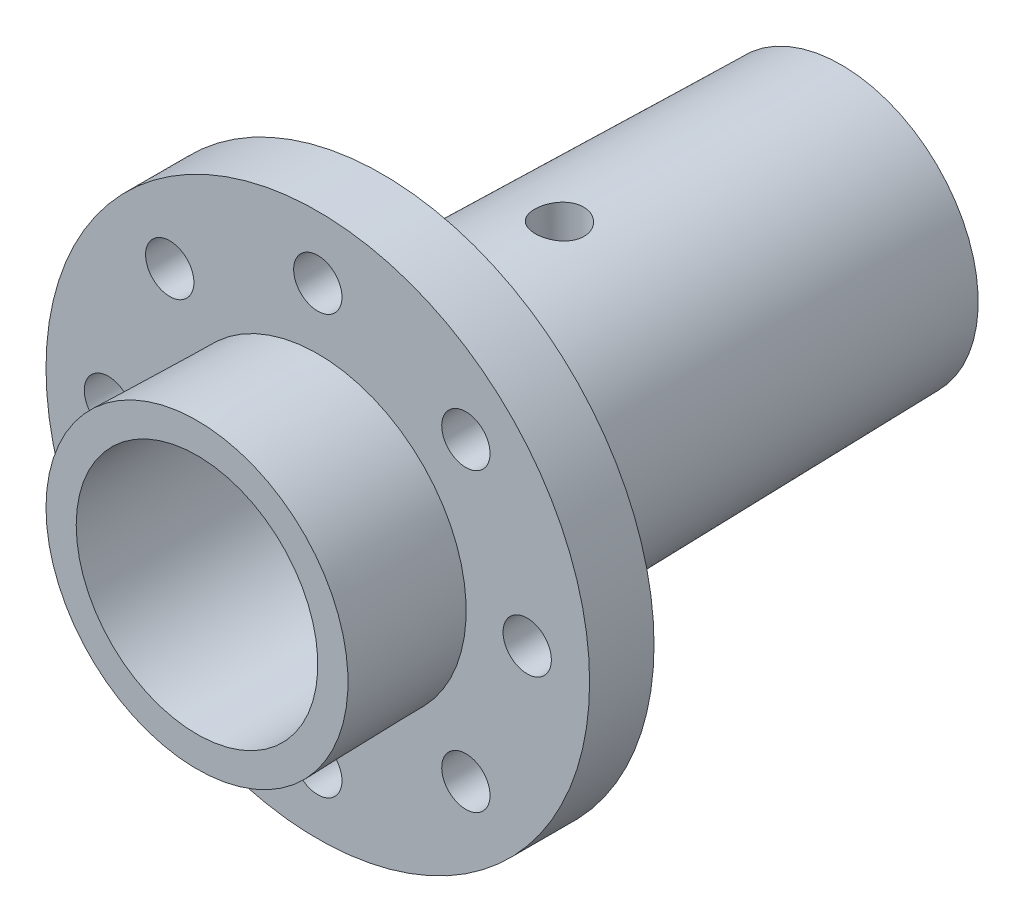
ISO-10303-21;
HEADER;
FILE_DESCRIPTION(('STEP AP214'),'2;1');
FILE_NAME('part.step','',(''),(''),'','','');
FILE_SCHEMA(('AUTOMOTIVE_DESIGN { 1 0 10303 214 1 1 1 1 }'));
ENDSEC;
DATA;
#1=APPLICATION_CONTEXT('core data for automotive mechanical design processes');
#2=APPLICATION_PROTOCOL_DEFINITION('international standard','automotive_design',2000,#1);
#3=PRODUCT_CONTEXT('',#1,'mechanical');
#4=PRODUCT('Part','Part','',(#3));
#5=PRODUCT_RELATED_PRODUCT_CATEGORY('part','',(#4));
#6=PRODUCT_DEFINITION_FORMATION('','',#4);
#7=PRODUCT_DEFINITION_CONTEXT('part definition',#1,'design');
#8=PRODUCT_DEFINITION('design','',#6,#7);
#9=PRODUCT_DEFINITION_SHAPE('','',#8);
#10=(LENGTH_UNIT() NAMED_UNIT(*) SI_UNIT(.MILLI.,.METRE.));
#11=(NAMED_UNIT(*) PLANE_ANGLE_UNIT() SI_UNIT($,.RADIAN.));
#12=(NAMED_UNIT(*) SI_UNIT($,.STERADIAN.) SOLID_ANGLE_UNIT());
#13=UNCERTAINTY_MEASURE_WITH_UNIT(LENGTH_MEASURE(1.E-05),#10,'distance_accuracy_value','');
#14=(GEOMETRIC_REPRESENTATION_CONTEXT(3) GLOBAL_UNCERTAINTY_ASSIGNED_CONTEXT((#13)) GLOBAL_UNIT_ASSIGNED_CONTEXT((#10,
#11,#12)) REPRESENTATION_CONTEXT('',''));
#15=CARTESIAN_POINT('',(0.,0.,0.));
#16=DIRECTION('',(0.,0.,1.));
#17=DIRECTION('',(1.,0.,0.));
#18=AXIS2_PLACEMENT_3D('',#15,#16,#17);
#19=CARTESIAN_POINT('',(0.,0.,-40.));
#20=DIRECTION('',(0.,0.,1.));
#21=DIRECTION('',(1.,0.,0.));
#22=AXIS2_PLACEMENT_3D('',#19,#20,#21);
#23=CONICAL_SURFACE('',#22,17.,0.0218715118250005);
#24=CARTESIAN_POINT('',(0.,0.,-40.));
#25=DIRECTION('',(0.,0.,-1.));
#26=DIRECTION('',(-1.,0.,0.));
#27=AXIS2_PLACEMENT_3D('',#24,#25,#26);
#28=CIRCLE('',#27,17.);
#29=CARTESIAN_POINT('',(-17.,0.,-40.));
#30=VERTEX_POINT('',#29);
#31=EDGE_CURVE('E10',#30,#30,#28,.T.);
#32=ORIENTED_EDGE('',*,*,#31,.F.);
#33=EDGE_LOOP('',(#32));
#34=FACE_BOUND('',#33,.T.);
#35=CARTESIAN_POINT('',(0.,0.,17.));
#36=DIRECTION('',(0.,0.,-1.));
#37=DIRECTION('',(-1.,0.,0.));
#38=AXIS2_PLACEMENT_3D('',#35,#36,#37);
#39=CIRCLE('',#38,18.246875);
#40=CARTESIAN_POINT('',(-18.246875,0.,17.));
#41=VERTEX_POINT('',#40);
#42=EDGE_CURVE('E58',#41,#41,#39,.T.);
#43=ORIENTED_EDGE('',*,*,#42,.T.);
#44=EDGE_LOOP('',(#43));
#45=FACE_BOUND('',#44,.T.);
#46=CARTESIAN_POINT('',(-2.13641248189681,17.5902905697979,-7.10612006001501));
#47=CARTESIAN_POINT('',(-2.01820031551979,17.6020045137629,-7.22602386010126));
#48=CARTESIAN_POINT('',(-1.88982058744187,17.6139661525499,-7.33600858004159));
#49=CARTESIAN_POINT('',(-1.6162869445784,17.6368416474846,-7.5329964557158));
#50=CARTESIAN_POINT('',(-1.47111788649196,17.6477545412079,-7.61997862802704));
#51=CARTESIAN_POINT('',(-1.16809070797555,17.6671433384036,-7.76839570893532));
#52=CARTESIAN_POINT('',(-1.01023276488835,17.6756192759278,-7.82983097450774));
#53=CARTESIAN_POINT('',(-0.686333859133014,17.689065282501,-7.92531122112214));
#54=CARTESIAN_POINT('',(-0.520294950041707,17.694036226621,-7.95936303912614));
#55=CARTESIAN_POINT('',(-0.185923391358476,17.6998311995654,-7.99893008702051));
#56=CARTESIAN_POINT('',(-0.0176139654522799,17.7006831514838,-8.00463747408034));
#57=CARTESIAN_POINT('',(0.317563716428026,17.6982101811075,-7.98786034793744));
#58=CARTESIAN_POINT('',(0.484431965140521,17.6948852377792,-7.96537569276771));
#59=CARTESIAN_POINT('',(0.811132773963448,17.684497707079,-7.89308081715635));
#60=CARTESIAN_POINT('',(0.970996321274204,17.6774538773261,-7.84340768638268));
#61=CARTESIAN_POINT('',(1.28013200786045,17.6605050653099,-7.71828461417816));
#62=CARTESIAN_POINT('',(1.42940363205517,17.6505999440219,-7.64283342020701));
#63=CARTESIAN_POINT('',(1.71432771184333,17.62906821204,-7.46764158209522));
#64=CARTESIAN_POINT('',(1.84987167205498,17.6174294505768,-7.36772600226923));
#65=CARTESIAN_POINT('',(2.10236916621167,17.593956123338,-7.14667233600477));
#66=CARTESIAN_POINT('',(2.21932171294242,17.5821215472014,-7.02553312329722));
#67=CARTESIAN_POINT('',(2.43219260158585,17.5597143499883,-6.764376648773));
#68=CARTESIAN_POINT('',(2.52794879117733,17.5491517214306,-6.62422625176943));
#69=CARTESIAN_POINT('',(2.69455614400661,17.5308646899681,-6.32965969767366));
#70=CARTESIAN_POINT('',(2.76540845692414,17.5231401560428,-6.17524419954114));
#71=CARTESIAN_POINT('',(2.87976110238903,17.5117549410538,-5.85750312953902));
#72=CARTESIAN_POINT('',(2.92342370253595,17.5080700491034,-5.69423686408784));
#73=CARTESIAN_POINT('',(2.98275636101598,17.5054181493743,-5.36266287458589));
#74=CARTESIAN_POINT('',(2.99842865392274,17.5064507649553,-5.19435555407278));
#75=CARTESIAN_POINT('',(3.0013303163255,17.513386061514,-4.85945558289645));
#76=CARTESIAN_POINT('',(2.98887006863653,17.5192351500835,-4.69286439416861));
#77=CARTESIAN_POINT('',(2.93658220982817,17.5353631334179,-4.36425952926706));
#78=CARTESIAN_POINT('',(2.89675409889852,17.5456421090831,-4.20224593674876));
#79=CARTESIAN_POINT('',(2.79082593580483,17.5697867418954,-3.88688160768614));
#80=CARTESIAN_POINT('',(2.72465934034243,17.5836614523234,-3.73355394534118));
#81=CARTESIAN_POINT('',(2.56797426163471,17.6137114001351,-3.44013581756344));
#82=CARTESIAN_POINT('',(2.47745352965398,17.6298868498922,-3.30004657611303));
#83=CARTESIAN_POINT('',(2.27310053393179,17.6632514186991,-3.0349511600539));
#84=CARTESIAN_POINT('',(2.15895566023728,17.6804516659265,-2.91018726445525));
#85=CARTESIAN_POINT('',(1.91128443507503,17.7139666168732,-2.68150857559569));
#86=CARTESIAN_POINT('',(1.77775729909239,17.7302812847111,-2.57759462666133));
#87=CARTESIAN_POINT('',(1.49423235508253,17.7604774636935,-2.3930829161153));
#88=CARTESIAN_POINT('',(1.34415519793755,17.7743463438858,-2.31260487080156));
#89=CARTESIAN_POINT('',(1.03229395559201,17.7981278245912,-2.17808578755983));
#90=CARTESIAN_POINT('',(0.870510913511206,17.808040777108,-2.12404239734322));
#91=CARTESIAN_POINT('',(0.54199976270117,17.8227833507028,-2.04459256647889));
#92=CARTESIAN_POINT('',(0.375359787573045,17.8276755235393,-2.01883345380201));
#93=CARTESIAN_POINT('',(0.040054840746956,17.8320899370389,-1.99556459756818));
#94=CARTESIAN_POINT('',(-0.128609956861912,17.8316126360991,-1.99805244254124));
#95=CARTESIAN_POINT('',(-0.460906486451055,17.8253794763081,-2.03097822125121));
#96=CARTESIAN_POINT('',(-0.624574954830384,17.819690877201,-2.06106001944891));
#97=CARTESIAN_POINT('',(-0.944491929754591,17.8037028908872,-2.14773724606901));
#98=CARTESIAN_POINT('',(-1.10074022920044,17.7934033750719,-2.2043334140366));
#99=CARTESIAN_POINT('',(-1.40229744693407,17.7691520222011,-2.3427038035544));
#100=CARTESIAN_POINT('',(-1.54754750742956,17.7551821087456,-2.42460300169717));
#101=CARTESIAN_POINT('',(-1.82235902100139,17.7249831852813,-2.61115184008497));
#102=CARTESIAN_POINT('',(-1.95191888835747,17.7087539472909,-2.71580377683971));
#103=CARTESIAN_POINT('',(-2.1938271868833,17.6753375873317,-2.94682418153255));
#104=CARTESIAN_POINT('',(-2.30587239330561,17.6581394044364,-3.07350872953194));
#105=CARTESIAN_POINT('',(-2.50718224619423,17.6247089006132,-3.34396352636239));
#106=CARTESIAN_POINT('',(-2.5964460434162,17.6084766157093,-3.48773441184443));
#107=CARTESIAN_POINT('',(-2.75002189445334,17.5784754509257,-3.78916419452177));
#108=CARTESIAN_POINT('',(-2.81421258131108,17.5647187228985,-3.94688621964626));
#109=CARTESIAN_POINT('',(-2.91506927353847,17.5410727609961,-4.27116837453528));
#110=CARTESIAN_POINT('',(-2.95173845485482,17.5311830809316,-4.43772748213588));
#111=CARTESIAN_POINT('',(-2.99609586288227,17.5162208851743,-4.7727972472299));
#112=CARTESIAN_POINT('',(-3.0041327450069,17.5110909831662,-4.9412591882312));
#113=CARTESIAN_POINT('',(-2.99188683457768,17.5057309368761,-5.27725671550963));
#114=CARTESIAN_POINT('',(-2.97160077837391,17.5055013573075,-5.44479219279697));
#115=CARTESIAN_POINT('',(-2.90364022840856,17.5096363762436,-5.77239539149831));
#116=CARTESIAN_POINT('',(-2.85623924200757,17.5139554531869,-5.93252067930991));
#117=CARTESIAN_POINT('',(-2.73566127702408,17.5263300753921,-6.2424847546913));
#118=CARTESIAN_POINT('',(-2.66250570972393,17.5343825186463,-6.39233196375953));
#119=CARTESIAN_POINT('',(-2.51583298174385,17.5504840360313,-6.63864896777253));
#120=CARTESIAN_POINT('',(-2.44787449704673,17.557933044654,-6.738517362246));
#121=CARTESIAN_POINT('',(-2.30048592149043,17.5736425520947,-6.92932578266738));
#122=CARTESIAN_POINT('',(-2.22105563191707,17.5819030649687,-7.02026565390989));
#123=CARTESIAN_POINT('',(-2.13641248189681,17.5902905697979,-7.10612006001501));
#124=B_SPLINE_CURVE_WITH_KNOTS('',3,(#46,#47,#48,#49,#50,#51,#52,#53,#54,#55,#56,#57,#58,#59,
#60,#61,#62,#63,#64,#65,#66,#67,#68,#69,#70,#71,#72,#73,#74,#75,#76,#77,#78,#79,#80,#81,#82,#83,
#84,#85,#86,#87,#88,#89,#90,#91,#92,#93,#94,#95,#96,#97,#98,#99,#100,#101,#102,#103,#104,#105,
#106,#107,#108,#109,#110,#111,#112,#113,#114,#115,#116,#117,#118,#119,#120,#121,#122,#123),
.UNSPECIFIED.,.T.,.F.,(4,2,2,2,2,2,2,2,2,2,2,2,2,2,2,2,2,2,2,2,2,2,2,2,2,2,2,2,2,2,2,2,2,2,2,2,
2,2,4),(0.,0.505919457244919,1.01229884552668,1.51867115776383,2.02491700221137,
2.52772609259036,3.03053771498118,3.53083710934032,4.03116081639843,4.53517235629679,
5.03921065055194,5.54698092895207,6.05472776321499,6.55941458158498,7.06406110706811,
7.5631671709221,8.06228235002772,8.56266661273795,9.06309709421736,9.57062979930826,
10.0781830529836,10.5882852733757,11.0983420940442,11.6019642247643,12.1055433611012,
12.6027132338826,13.0998969746716,13.5995767598584,14.099307002824,14.6069081304926,
15.1145281777299,15.6245757914701,16.1345645373111,16.6383215130648,17.142136541486,
17.6409570282245,18.1393637919567,18.5016097094647,18.8638619025357),.UNSPECIFIED.);
#125=CARTESIAN_POINT('',(-2.13641248189681,17.5902905697979,-7.10612006001501));
#126=VERTEX_POINT('',#125);
#127=EDGE_CURVE('E111',#126,#126,#124,.T.);
#128=ORIENTED_EDGE('',*,*,#127,.T.);
#129=EDGE_LOOP('',(#128));
#130=FACE_BOUND('',#129,.T.);
#131=ADVANCED_FACE('F35',(#34,#45,#130),#23,.T.);
#132=CARTESIAN_POINT('',(0.,0.,-65.0810987124463));
#133=DIRECTION('',(0.,0.,-1.));
#134=DIRECTION('',(-1.,0.,0.));
#135=AXIS2_PLACEMENT_3D('',#132,#133,#134);
#136=CYLINDRICAL_SURFACE('',#135,12.);
#137=CARTESIAN_POINT('',(0.,0.,-40.));
#138=DIRECTION('',(0.,0.,-1.));
#139=DIRECTION('',(-1.,0.,0.));
#140=AXIS2_PLACEMENT_3D('',#137,#138,#139);
#141=CIRCLE('',#140,12.);
#142=CARTESIAN_POINT('',(-12.,0.,-40.));
#143=VERTEX_POINT('',#142);
#144=EDGE_CURVE('E48',#143,#143,#141,.T.);
#145=ORIENTED_EDGE('',*,*,#144,.T.);
#146=EDGE_LOOP('',(#145));
#147=FACE_BOUND('',#146,.T.);
#148=CARTESIAN_POINT('',(0.,0.,10.));
#149=DIRECTION('',(0.,0.,-1.));
#150=DIRECTION('',(-1.,0.,0.));
#151=AXIS2_PLACEMENT_3D('',#148,#149,#150);
#152=CIRCLE('',#151,12.);
#153=CARTESIAN_POINT('',(-12.,0.,10.));
#154=VERTEX_POINT('',#153);
#155=EDGE_CURVE('E56',#154,#154,#152,.T.);
#156=ORIENTED_EDGE('',*,*,#155,.F.);
#157=EDGE_LOOP('',(#156));
#158=FACE_BOUND('',#157,.T.);
#159=CARTESIAN_POINT('',(0.,12.,-8.));
#160=CARTESIAN_POINT('',(-0.165752177339462,11.9999971973602,-7.99999534852368));
#161=CARTESIAN_POINT('',(-0.331556315661526,11.9965315626365,-7.98621689845242));
#162=CARTESIAN_POINT('',(-0.658412647541066,11.9830422765979,-7.93154969738599));
#163=CARTESIAN_POINT('',(-0.819462093741479,11.9730149083995,-7.8906455809243));
#164=CARTESIAN_POINT('',(-1.13204174436515,11.9475125266406,-7.78312149307583));
#165=CARTESIAN_POINT('',(-1.28358312686,11.9320440568412,-7.71653240256946));
#166=CARTESIAN_POINT('',(-1.57334426380885,11.8973068761524,-7.55963721991031));
#167=CARTESIAN_POINT('',(-1.71156356869753,11.8780380370831,-7.46933032776206));
#168=CARTESIAN_POINT('',(-1.97360385460183,11.8373482718339,-7.26559842069164));
#169=CARTESIAN_POINT('',(-2.09711138012211,11.8158941429625,-7.15177685008188));
#170=CARTESIAN_POINT('',(-2.32349785440664,11.7734724023587,-6.90509559018193));
#171=CARTESIAN_POINT('',(-2.42637447389838,11.7525048457973,-6.77223375410613));
#172=CARTESIAN_POINT('',(-2.61005308559795,11.7130955139634,-6.48880954652602));
#173=CARTESIAN_POINT('',(-2.69050443185028,11.6946958892962,-6.33801353838254));
#174=CARTESIAN_POINT('',(-2.82479381710149,11.6629898963603,-6.02450317667993));
#175=CARTESIAN_POINT('',(-2.87863611088028,11.6496827138884,-5.86179073333597));
#176=CARTESIAN_POINT('',(-2.95710967360953,11.6300095339265,-5.53251300359668));
#177=CARTESIAN_POINT('',(-2.98230453666411,11.6235098199402,-5.36609020792401));
#178=CARTESIAN_POINT('',(-3.00452355013282,11.6177872491918,-5.03126286200131));
#179=CARTESIAN_POINT('',(-3.00155228363622,11.6185632085586,-4.86285863861572));
#180=CARTESIAN_POINT('',(-2.96797304927941,11.6271841103363,-4.53316838450929));
#181=CARTESIAN_POINT('',(-2.93803668038127,11.6348572601459,-4.37180875706934));
#182=CARTESIAN_POINT('',(-2.85244837380599,11.6561341934214,-4.05647789817788));
#183=CARTESIAN_POINT('',(-2.79679460413879,11.6697383993848,-3.90250719394216));
#184=CARTESIAN_POINT('',(-2.66077895587437,11.7015022781132,-3.60452396749574));
#185=CARTESIAN_POINT('',(-2.58017333446584,11.7197065493963,-3.46062765642086));
#186=CARTESIAN_POINT('',(-2.39671255202989,11.7585942169198,-3.18816258048636));
#187=CARTESIAN_POINT('',(-2.29385349761767,11.7792780466926,-3.0595965038655));
#188=CARTESIAN_POINT('',(-2.06532684936244,11.8215176107978,-2.81759276861119));
#189=CARTESIAN_POINT('',(-1.93909251633172,11.84308138956,-2.7046910198773));
#190=CARTESIAN_POINT('',(-1.6692238350074,11.8841193115751,-2.50155751507219));
#191=CARTESIAN_POINT('',(-1.52558895541589,11.9035933909881,-2.41132645147287));
#192=CARTESIAN_POINT('',(-1.22423177736278,11.9383546418838,-2.25589882755123));
#193=CARTESIAN_POINT('',(-1.06646278641725,11.9536272025545,-2.19078931949114));
#194=CARTESIAN_POINT('',(-0.741752016285765,11.9781583398283,-2.08816538858085));
#195=CARTESIAN_POINT('',(-0.574811998300969,11.9874180667856,-2.05064568716372));
#196=CARTESIAN_POINT('',(-0.241079940780054,11.9987099854275,-2.00508486888232));
#197=CARTESIAN_POINT('',(-0.0743934399764205,12.0009210701655,-1.99631394784939));
#198=CARTESIAN_POINT('',(0.258065749603017,11.998376096289,-2.00649800411097));
#199=CARTESIAN_POINT('',(0.423838519289192,11.9936206648371,-2.02545048559827));
#200=CARTESIAN_POINT('',(0.747228537552981,11.977791622547,-2.08994181678275));
#201=CARTESIAN_POINT('',(0.9049302379375,11.9668126837158,-2.13508252695394));
#202=CARTESIAN_POINT('',(1.21051458490503,11.9397741326831,-2.25021416805692));
#203=CARTESIAN_POINT('',(1.3583962380653,11.9237140073996,-2.32020760862644));
#204=CARTESIAN_POINT('',(1.64304626885966,11.8878661585244,-2.48447225774935));
#205=CARTESIAN_POINT('',(1.77957088367153,11.868017347332,-2.57915222479313));
#206=CARTESIAN_POINT('',(2.03505322728662,11.826890183755,-2.78957981759433));
#207=CARTESIAN_POINT('',(2.1540079179465,11.8056115850589,-2.90533107923529));
#208=CARTESIAN_POINT('',(2.37398113614497,11.76337913919,-3.15800392168741));
#209=CARTESIAN_POINT('',(2.47448773524221,11.7424460836496,-3.29537540599912));
#210=CARTESIAN_POINT('',(2.65102151802725,11.7038575676408,-3.58546526893716));
#211=CARTESIAN_POINT('',(2.72704978832281,11.6862019616993,-3.73818296594089));
#212=CARTESIAN_POINT('',(2.85190284121468,11.656361894336,-4.05381144481247));
#213=CARTESIAN_POINT('',(2.90088879328717,11.6441451045097,-4.21665525662459));
#214=CARTESIAN_POINT('',(2.97069131988587,11.626534880479,-4.54861927571059));
#215=CARTESIAN_POINT('',(2.99151405495183,11.6211399540485,-4.7177381020429));
#216=CARTESIAN_POINT('',(3.004077180673,11.6178980244193,-5.05224204772322));
#217=CARTESIAN_POINT('',(2.99663579556158,11.6198386546564,-5.21759487025289));
#218=CARTESIAN_POINT('',(2.95475455662439,11.6305581800657,-5.54460777733253));
#219=CARTESIAN_POINT('',(2.92031524537318,11.6393369378128,-5.70626793602638));
#220=CARTESIAN_POINT('',(2.82586263888594,11.6626252136787,-6.02041691813173));
#221=CARTESIAN_POINT('',(2.76600280936085,11.6771003047327,-6.17295461048066));
#222=CARTESIAN_POINT('',(2.62252982721004,11.7101551144901,-6.46593076542713));
#223=CARTESIAN_POINT('',(2.53891338006835,11.7287354024137,-6.60636754637376));
#224=CARTESIAN_POINT('',(2.3477354972743,11.768512685272,-6.87510925800411));
#225=CARTESIAN_POINT('',(2.23960632582451,11.7897652966356,-7.00300214684793));
#226=CARTESIAN_POINT('',(2.00357874237946,11.8321605449252,-7.2390940895908));
#227=CARTESIAN_POINT('',(1.87567564252229,11.8533031545411,-7.34728846022593));
#228=CARTESIAN_POINT('',(1.60093517340518,11.8935531129534,-7.54282261712922));
#229=CARTESIAN_POINT('',(1.45379684463277,11.9126166673174,-7.62974922734316));
#230=CARTESIAN_POINT('',(1.14653211902095,11.9460984995023,-7.77749492588106));
#231=CARTESIAN_POINT('',(0.986415126873477,11.9605201039956,-7.83833272129707));
#232=CARTESIAN_POINT('',(0.688820506486942,11.9809611913108,-7.9231436606593));
#233=CARTESIAN_POINT('',(0.552760341816136,11.9880517010538,-7.95190248610687));
#234=CARTESIAN_POINT('',(0.277812143072567,11.997572104639,-7.99033188724388));
#235=CARTESIAN_POINT('',(0.138924322485233,12.0000023490179,-8.0000038986106));
#236=CARTESIAN_POINT('',(0.,12.,-8.));
#237=B_SPLINE_CURVE_WITH_KNOTS('',3,(#159,#160,#161,#162,#163,#164,#165,#166,#167,#168,#169,
#170,#171,#172,#173,#174,#175,#176,#177,#178,#179,#180,#181,#182,#183,#184,#185,#186,#187,#188,
#189,#190,#191,#192,#193,#194,#195,#196,#197,#198,#199,#200,#201,#202,#203,#204,#205,#206,#207,
#208,#209,#210,#211,#212,#213,#214,#215,#216,#217,#218,#219,#220,#221,#222,#223,#224,#225,#226,
#227,#228,#229,#230,#231,#232,#233,#234,#235,#236),.UNSPECIFIED.,.T.,.F.,(4,2,2,2,2,2,2,2,2,2,2,
2,2,2,2,2,2,2,2,2,2,2,2,2,2,2,2,2,2,2,2,2,2,2,2,2,2,2,4),(0.,0.496747424943779,
0.993776475527799,1.49020980457221,1.98665988033866,2.49228870874278,2.99797459160124,
3.51117295091614,4.02428922338737,4.52712590202139,5.02988076232035,5.52044994020677,
6.01105406938718,6.506610557544,7.00225381678967,7.5120300194468,8.02182179123136,
8.53336458024869,9.04480947383927,9.54316617905194,10.0414780223213,10.5324054903472,
11.0233825465122,11.5230717513735,12.0228472602268,12.5348901841559,13.0469103750566,
13.5558450923716,14.0646684651657,14.5588756080898,15.0530728192382,15.5443280113065,
16.0356513628556,16.5397915283158,17.0440513955259,17.5574437101093,18.0704672765446,
18.4868448589605,18.9031911209784),.UNSPECIFIED.);
#238=CARTESIAN_POINT('',(0.,12.,-8.));
#239=VERTEX_POINT('',#238);
#240=EDGE_CURVE('E39',#239,#239,#237,.T.);
#241=ORIENTED_EDGE('',*,*,#240,.T.);
#242=EDGE_LOOP('',(#241));
#243=FACE_BOUND('',#242,.T.);
#244=ADVANCED_FACE('F98',(#147,#158,#243),#136,.F.);
#245=CARTESIAN_POINT('',(-17.,0.,-40.));
#246=DIRECTION('',(0.,0.,-1.));
#247=DIRECTION('',(-1.,0.,0.));
#248=AXIS2_PLACEMENT_3D('',#245,#246,#247);
#249=PLANE('',#248);
#250=ORIENTED_EDGE('',*,*,#31,.T.);
#251=EDGE_LOOP('',(#250));
#252=FACE_BOUND('',#251,.T.);
#253=ORIENTED_EDGE('',*,*,#144,.F.);
#254=EDGE_LOOP('',(#253));
#255=FACE_BOUND('',#254,.T.);
#256=ADVANCED_FACE('F90',(#252,#255),#249,.T.);
#257=CARTESIAN_POINT('',(-12.,0.,40.));
#258=DIRECTION('',(0.,0.,1.));
#259=DIRECTION('',(1.,0.,0.));
#260=AXIS2_PLACEMENT_3D('',#257,#258,#259);
#261=PLANE('',#260);
#262=CARTESIAN_POINT('',(0.,0.,40.));
#263=DIRECTION('',(0.,0.,-1.));
#264=DIRECTION('',(-1.,0.,0.));
#265=AXIS2_PLACEMENT_3D('',#262,#263,#264);
#266=CIRCLE('',#265,15.);
#267=CARTESIAN_POINT('',(-15.,0.,40.));
#268=VERTEX_POINT('',#267);
#269=EDGE_CURVE('E59',#268,#268,#266,.T.);
#270=ORIENTED_EDGE('',*,*,#269,.T.);
#271=EDGE_LOOP('',(#270));
#272=FACE_BOUND('',#271,.T.);
#273=CARTESIAN_POINT('',(0.,0.,40.));
#274=DIRECTION('',(0.,0.,-1.));
#275=DIRECTION('',(-1.,0.,0.));
#276=AXIS2_PLACEMENT_3D('',#273,#274,#275);
#277=CIRCLE('',#276,18.75);
#278=CARTESIAN_POINT('',(-18.75,0.,40.));
#279=VERTEX_POINT('',#278);
#280=EDGE_CURVE('E53',#279,#279,#277,.T.);
#281=ORIENTED_EDGE('',*,*,#280,.F.);
#282=EDGE_LOOP('',(#281));
#283=FACE_BOUND('',#282,.T.);
#284=ADVANCED_FACE('F88',(#272,#283),#261,.T.);
#285=CARTESIAN_POINT('',(0.,0.,25.));
#286=DIRECTION('',(0.,0.,1.));
#287=DIRECTION('',(1.,0.,0.));
#288=AXIS2_PLACEMENT_3D('',#285,#286,#287);
#289=CONICAL_SURFACE('',#288,18.421875,0.0218715118250006);
#290=ORIENTED_EDGE('',*,*,#280,.T.);
#291=EDGE_LOOP('',(#290));
#292=FACE_BOUND('',#291,.T.);
#293=CARTESIAN_POINT('',(0.,0.,25.));
#294=DIRECTION('',(0.,0.,-1.));
#295=DIRECTION('',(-1.,0.,0.));
#296=AXIS2_PLACEMENT_3D('',#293,#294,#295);
#297=CIRCLE('',#296,18.421875);
#298=CARTESIAN_POINT('',(-18.421875,0.,25.));
#299=VERTEX_POINT('',#298);
#300=EDGE_CURVE('E80',#299,#299,#297,.T.);
#301=ORIENTED_EDGE('',*,*,#300,.F.);
#302=EDGE_LOOP('',(#301));
#303=FACE_BOUND('',#302,.T.);
#304=ADVANCED_FACE('F85',(#292,#303),#289,.T.);
#305=CARTESIAN_POINT('',(-18.421875,0.,25.));
#306=DIRECTION('',(0.,0.,1.));
#307=DIRECTION('',(1.,0.,0.));
#308=AXIS2_PLACEMENT_3D('',#305,#306,#307);
#309=PLANE('',#308);
#310=CARTESIAN_POINT('',(-26.,0.,25.));
#311=DIRECTION('',(0.,0.,1.));
#312=DIRECTION('',(1.,0.,0.));
#313=AXIS2_PLACEMENT_3D('',#310,#311,#312);
#314=CIRCLE('',#313,3.);
#315=CARTESIAN_POINT('',(-23.,0.,25.));
#316=VERTEX_POINT('',#315);
#317=EDGE_CURVE('E183',#316,#316,#314,.T.);
#318=ORIENTED_EDGE('',*,*,#317,.F.);
#319=EDGE_LOOP('',(#318));
#320=FACE_BOUND('',#319,.T.);
#321=CARTESIAN_POINT('',(-18.3847763108501,18.3847763108503,25.));
#322=DIRECTION('',(0.,0.,1.));
#323=DIRECTION('',(1.,0.,0.));
#324=AXIS2_PLACEMENT_3D('',#321,#322,#323);
#325=CIRCLE('',#324,3.);
#326=CARTESIAN_POINT('',(-15.3847763108501,18.3847763108503,25.));
#327=VERTEX_POINT('',#326);
#328=EDGE_CURVE('E187',#327,#327,#325,.T.);
#329=ORIENTED_EDGE('',*,*,#328,.F.);
#330=EDGE_LOOP('',(#329));
#331=FACE_BOUND('',#330,.T.);
#332=CARTESIAN_POINT('',(0.,26.,25.));
#333=DIRECTION('',(0.,0.,1.));
#334=DIRECTION('',(1.,0.,0.));
#335=AXIS2_PLACEMENT_3D('',#332,#333,#334);
#336=CIRCLE('',#335,3.);
#337=CARTESIAN_POINT('',(3.,26.,25.));
#338=VERTEX_POINT('',#337);
#339=EDGE_CURVE('E191',#338,#338,#336,.T.);
#340=ORIENTED_EDGE('',*,*,#339,.F.);
#341=EDGE_LOOP('',(#340));
#342=FACE_BOUND('',#341,.T.);
#343=CARTESIAN_POINT('',(18.3847763108504,18.3847763108501,25.));
#344=DIRECTION('',(0.,0.,1.));
#345=DIRECTION('',(1.,0.,0.));
#346=AXIS2_PLACEMENT_3D('',#343,#344,#345);
#347=CIRCLE('',#346,3.);
#348=CARTESIAN_POINT('',(21.3847763108504,18.3847763108501,25.));
#349=VERTEX_POINT('',#348);
#350=EDGE_CURVE('E195',#349,#349,#347,.T.);
#351=ORIENTED_EDGE('',*,*,#350,.F.);
#352=EDGE_LOOP('',(#351));
#353=FACE_BOUND('',#352,.T.);
#354=CARTESIAN_POINT('',(26.,-2.72335544429764E-13,25.));
#355=DIRECTION('',(0.,0.,1.));
#356=DIRECTION('',(1.,0.,0.));
#357=AXIS2_PLACEMENT_3D('',#354,#355,#356);
#358=CIRCLE('',#357,3.);
#359=CARTESIAN_POINT('',(29.,-2.72335544429764E-13,25.));
#360=VERTEX_POINT('',#359);
#361=EDGE_CURVE('E199',#360,#360,#358,.T.);
#362=ORIENTED_EDGE('',*,*,#361,.F.);
#363=EDGE_LOOP('',(#362));
#364=FACE_BOUND('',#363,.T.);
#365=CARTESIAN_POINT('',(18.38477631085,-18.3847763108505,25.));
#366=DIRECTION('',(0.,0.,1.));
#367=DIRECTION('',(1.,0.,0.));
#368=AXIS2_PLACEMENT_3D('',#365,#366,#367);
#369=CIRCLE('',#368,3.);
#370=CARTESIAN_POINT('',(21.38477631085,-18.3847763108505,25.));
#371=VERTEX_POINT('',#370);
#372=EDGE_CURVE('E203',#371,#371,#369,.T.);
#373=ORIENTED_EDGE('',*,*,#372,.F.);
#374=EDGE_LOOP('',(#373));
#375=FACE_BOUND('',#374,.T.);
#376=CARTESIAN_POINT('',(-18.3847763108503,-18.3847763108502,25.));
#377=DIRECTION('',(0.,0.,1.));
#378=DIRECTION('',(1.,0.,0.));
#379=AXIS2_PLACEMENT_3D('',#376,#377,#378);
#380=CIRCLE('',#379,3.);
#381=CARTESIAN_POINT('',(-15.3847763108503,-18.3847763108502,25.));
#382=VERTEX_POINT('',#381);
#383=EDGE_CURVE('E207',#382,#382,#380,.T.);
#384=ORIENTED_EDGE('',*,*,#383,.F.);
#385=EDGE_LOOP('',(#384));
#386=FACE_BOUND('',#385,.T.);
#387=CARTESIAN_POINT('',(0.,-26.,25.));
#388=DIRECTION('',(0.,0.,1.));
#389=DIRECTION('',(1.,0.,0.));
#390=AXIS2_PLACEMENT_3D('',#387,#388,#389);
#391=CIRCLE('',#390,3.);
#392=CARTESIAN_POINT('',(3.,-26.,25.));
#393=VERTEX_POINT('',#392);
#394=EDGE_CURVE('E71',#393,#393,#391,.T.);
#395=ORIENTED_EDGE('',*,*,#394,.F.);
#396=EDGE_LOOP('',(#395));
#397=FACE_BOUND('',#396,.T.);
#398=ORIENTED_EDGE('',*,*,#300,.T.);
#399=EDGE_LOOP('',(#398));
#400=FACE_BOUND('',#399,.T.);
#401=CARTESIAN_POINT('',(0.,0.,25.));
#402=DIRECTION('',(0.,0.,-1.));
#403=DIRECTION('',(-1.,0.,0.));
#404=AXIS2_PLACEMENT_3D('',#401,#402,#403);
#405=CIRCLE('',#404,33.75);
#406=CARTESIAN_POINT('',(-33.75,0.,25.));
#407=VERTEX_POINT('',#406);
#408=EDGE_CURVE('E77',#407,#407,#405,.T.);
#409=ORIENTED_EDGE('',*,*,#408,.F.);
#410=EDGE_LOOP('',(#409));
#411=FACE_BOUND('',#410,.T.);
#412=ADVANCED_FACE('F96',(#320,#331,#342,#353,#364,#375,#386,#397,#400,#411),#309,.T.);
#413=CARTESIAN_POINT('',(0.,0.,-65.0810987124463));
#414=DIRECTION('',(0.,0.,-1.));
#415=DIRECTION('',(-1.,0.,0.));
#416=AXIS2_PLACEMENT_3D('',#413,#414,#415);
#417=CYLINDRICAL_SURFACE('',#416,33.75);
#418=ORIENTED_EDGE('',*,*,#408,.T.);
#419=EDGE_LOOP('',(#418));
#420=FACE_BOUND('',#419,.T.);
#421=CARTESIAN_POINT('',(0.,0.,17.));
#422=DIRECTION('',(0.,0.,-1.));
#423=DIRECTION('',(-1.,0.,0.));
#424=AXIS2_PLACEMENT_3D('',#421,#422,#423);
#425=CIRCLE('',#424,33.75);
#426=CARTESIAN_POINT('',(-33.75,0.,17.));
#427=VERTEX_POINT('',#426);
#428=EDGE_CURVE('E63',#427,#427,#425,.T.);
#429=ORIENTED_EDGE('',*,*,#428,.F.);
#430=EDGE_LOOP('',(#429));
#431=FACE_BOUND('',#430,.T.);
#432=ADVANCED_FACE('F170',(#420,#431),#417,.T.);
#433=CARTESIAN_POINT('',(-33.75,0.,17.));
#434=DIRECTION('',(0.,0.,-1.));
#435=DIRECTION('',(-1.,0.,0.));
#436=AXIS2_PLACEMENT_3D('',#433,#434,#435);
#437=PLANE('',#436);
#438=CARTESIAN_POINT('',(-26.,0.,17.));
#439=DIRECTION('',(0.,0.,-1.));
#440=DIRECTION('',(0.,1.,0.));
#441=AXIS2_PLACEMENT_3D('',#438,#439,#440);
#442=CIRCLE('',#441,3.);
#443=CARTESIAN_POINT('',(-26.,3.00000000000009,17.));
#444=VERTEX_POINT('',#443);
#445=EDGE_CURVE('E232',#444,#444,#442,.T.);
#446=ORIENTED_EDGE('',*,*,#445,.F.);
#447=EDGE_LOOP('',(#446));
#448=FACE_BOUND('',#447,.T.);
#449=CARTESIAN_POINT('',(-18.3847763108501,18.3847763108503,17.));
#450=DIRECTION('',(0.,0.,-1.));
#451=DIRECTION('',(0.707106781186551,0.707106781186544,0.));
#452=AXIS2_PLACEMENT_3D('',#449,#450,#451);
#453=CIRCLE('',#452,3.);
#454=CARTESIAN_POINT('',(-16.2634559672905,20.50609665441,17.));
#455=VERTEX_POINT('',#454);
#456=EDGE_CURVE('E239',#455,#455,#453,.T.);
#457=ORIENTED_EDGE('',*,*,#456,.F.);
#458=EDGE_LOOP('',(#457));
#459=FACE_BOUND('',#458,.T.);
#460=CARTESIAN_POINT('',(0.,26.,17.));
#461=DIRECTION('',(0.,0.,-1.));
#462=DIRECTION('',(1.,0.,0.));
#463=AXIS2_PLACEMENT_3D('',#460,#461,#462);
#464=CIRCLE('',#463,3.);
#465=CARTESIAN_POINT('',(3.,26.,17.));
#466=VERTEX_POINT('',#465);
#467=EDGE_CURVE('E236',#466,#466,#464,.T.);
#468=ORIENTED_EDGE('',*,*,#467,.F.);
#469=EDGE_LOOP('',(#468));
#470=FACE_BOUND('',#469,.T.);
#471=CARTESIAN_POINT('',(18.3847763108504,18.3847763108501,17.));
#472=DIRECTION('',(0.,0.,-1.));
#473=DIRECTION('',(0.707106781186541,-0.707106781186554,0.));
#474=AXIS2_PLACEMENT_3D('',#471,#472,#473);
#475=CIRCLE('',#474,3.);
#476=CARTESIAN_POINT('',(20.50609665441,16.2634559672904,17.));
#477=VERTEX_POINT('',#476);
#478=EDGE_CURVE('E233',#477,#477,#475,.T.);
#479=ORIENTED_EDGE('',*,*,#478,.F.);
#480=EDGE_LOOP('',(#479));
#481=FACE_BOUND('',#480,.T.);
#482=CARTESIAN_POINT('',(26.,-2.72335544429764E-13,17.));
#483=DIRECTION('',(0.,0.,-1.));
#484=DIRECTION('',(0.,-1.,0.));
#485=AXIS2_PLACEMENT_3D('',#482,#483,#484);
#486=CIRCLE('',#485,3.);
#487=CARTESIAN_POINT('',(26.,-3.00000000000027,17.));
#488=VERTEX_POINT('',#487);
#489=EDGE_CURVE('E116',#488,#488,#486,.T.);
#490=ORIENTED_EDGE('',*,*,#489,.F.);
#491=EDGE_LOOP('',(#490));
#492=FACE_BOUND('',#491,.T.);
#493=CARTESIAN_POINT('',(18.38477631085,-18.3847763108505,17.));
#494=DIRECTION('',(0.,0.,-1.));
#495=DIRECTION('',(-0.707106781186556,-0.707106781186539,0.));
#496=AXIS2_PLACEMENT_3D('',#493,#494,#495);
#497=CIRCLE('',#496,3.);
#498=CARTESIAN_POINT('',(16.2634559672903,-20.5060966544101,17.));
#499=VERTEX_POINT('',#498);
#500=EDGE_CURVE('E113',#499,#499,#497,.T.);
#501=ORIENTED_EDGE('',*,*,#500,.F.);
#502=EDGE_LOOP('',(#501));
#503=FACE_BOUND('',#502,.T.);
#504=CARTESIAN_POINT('',(-18.3847763108503,-18.3847763108502,17.));
#505=DIRECTION('',(0.,0.,-1.));
#506=DIRECTION('',(-0.707106781186546,0.707106781186549,0.));
#507=AXIS2_PLACEMENT_3D('',#504,#505,#506);
#508=CIRCLE('',#507,3.);
#509=CARTESIAN_POINT('',(-20.5060966544099,-16.2634559672906,17.));
#510=VERTEX_POINT('',#509);
#511=EDGE_CURVE('E229',#510,#510,#508,.T.);
#512=ORIENTED_EDGE('',*,*,#511,.F.);
#513=EDGE_LOOP('',(#512));
#514=FACE_BOUND('',#513,.T.);
#515=CARTESIAN_POINT('',(0.,-26.,17.));
#516=DIRECTION('',(0.,0.,-1.));
#517=DIRECTION('',(-1.,0.,0.));
#518=AXIS2_PLACEMENT_3D('',#515,#516,#517);
#519=CIRCLE('',#518,3.);
#520=CARTESIAN_POINT('',(-3.,-26.,17.));
#521=VERTEX_POINT('',#520);
#522=EDGE_CURVE('E218',#521,#521,#519,.T.);
#523=ORIENTED_EDGE('',*,*,#522,.F.);
#524=EDGE_LOOP('',(#523));
#525=FACE_BOUND('',#524,.T.);
#526=ORIENTED_EDGE('',*,*,#428,.T.);
#527=EDGE_LOOP('',(#526));
#528=FACE_BOUND('',#527,.T.);
#529=ORIENTED_EDGE('',*,*,#42,.F.);
#530=EDGE_LOOP('',(#529));
#531=FACE_BOUND('',#530,.T.);
#532=ADVANCED_FACE('F166',(#448,#459,#470,#481,#492,#503,#514,#525,#528,#531),#437,.T.);
#533=CARTESIAN_POINT('',(0.,0.,-67.558392606748));
#534=DIRECTION('',(0.,0.,-1.));
#535=DIRECTION('',(-1.,0.,0.));
#536=AXIS2_PLACEMENT_3D('',#533,#534,#535);
#537=CYLINDRICAL_SURFACE('',#536,15.);
#538=ORIENTED_EDGE('',*,*,#269,.F.);
#539=EDGE_LOOP('',(#538));
#540=FACE_BOUND('',#539,.T.);
#541=CARTESIAN_POINT('',(0.,0.,10.));
#542=DIRECTION('',(0.,0.,-1.));
#543=DIRECTION('',(-1.,0.,0.));
#544=AXIS2_PLACEMENT_3D('',#541,#542,#543);
#545=CIRCLE('',#544,15.);
#546=CARTESIAN_POINT('',(-15.,0.,10.));
#547=VERTEX_POINT('',#546);
#548=EDGE_CURVE('E66',#547,#547,#545,.T.);
#549=ORIENTED_EDGE('',*,*,#548,.T.);
#550=EDGE_LOOP('',(#549));
#551=FACE_BOUND('',#550,.T.);
#552=ADVANCED_FACE('F163',(#540,#551),#537,.F.);
#553=CARTESIAN_POINT('',(-15.,0.,10.));
#554=DIRECTION('',(0.,0.,-1.));
#555=DIRECTION('',(-1.,0.,0.));
#556=AXIS2_PLACEMENT_3D('',#553,#554,#555);
#557=PLANE('',#556);
#558=ORIENTED_EDGE('',*,*,#155,.T.);
#559=EDGE_LOOP('',(#558));
#560=FACE_BOUND('',#559,.T.);
#561=ORIENTED_EDGE('',*,*,#548,.F.);
#562=EDGE_LOOP('',(#561));
#563=FACE_BOUND('',#562,.T.);
#564=ADVANCED_FACE('F159',(#560,#563),#557,.F.);
#565=CARTESIAN_POINT('',(0.,-26.,40.));
#566=DIRECTION('',(0.,0.,-1.));
#567=DIRECTION('',(-1.,0.,0.));
#568=AXIS2_PLACEMENT_3D('',#565,#566,#567);
#569=CYLINDRICAL_SURFACE('',#568,3.);
#570=ORIENTED_EDGE('',*,*,#394,.T.);
#571=EDGE_LOOP('',(#570));
#572=FACE_BOUND('',#571,.T.);
#573=ORIENTED_EDGE('',*,*,#522,.T.);
#574=EDGE_LOOP('',(#573));
#575=FACE_BOUND('',#574,.T.);
#576=ADVANCED_FACE('F155',(#572,#575),#569,.F.);
#577=CARTESIAN_POINT('',(-18.3847763108503,-18.3847763108502,40.));
#578=DIRECTION('',(0.,0.,-1.));
#579=DIRECTION('',(-1.,0.,0.));
#580=AXIS2_PLACEMENT_3D('',#577,#578,#579);
#581=CYLINDRICAL_SURFACE('',#580,3.);
#582=ORIENTED_EDGE('',*,*,#383,.T.);
#583=EDGE_LOOP('',(#582));
#584=FACE_BOUND('',#583,.T.);
#585=ORIENTED_EDGE('',*,*,#511,.T.);
#586=EDGE_LOOP('',(#585));
#587=FACE_BOUND('',#586,.T.);
#588=ADVANCED_FACE('F137',(#584,#587),#581,.F.);
#589=CARTESIAN_POINT('',(18.38477631085,-18.3847763108505,40.));
#590=DIRECTION('',(0.,0.,-1.));
#591=DIRECTION('',(-1.,0.,0.));
#592=AXIS2_PLACEMENT_3D('',#589,#590,#591);
#593=CYLINDRICAL_SURFACE('',#592,3.);
#594=ORIENTED_EDGE('',*,*,#372,.T.);
#595=EDGE_LOOP('',(#594));
#596=FACE_BOUND('',#595,.T.);
#597=ORIENTED_EDGE('',*,*,#500,.T.);
#598=EDGE_LOOP('',(#597));
#599=FACE_BOUND('',#598,.T.);
#600=ADVANCED_FACE('F133',(#596,#599),#593,.F.);
#601=CARTESIAN_POINT('',(26.,-2.72335544429764E-13,40.));
#602=DIRECTION('',(0.,0.,-1.));
#603=DIRECTION('',(-1.,0.,0.));
#604=AXIS2_PLACEMENT_3D('',#601,#602,#603);
#605=CYLINDRICAL_SURFACE('',#604,3.);
#606=ORIENTED_EDGE('',*,*,#361,.T.);
#607=EDGE_LOOP('',(#606));
#608=FACE_BOUND('',#607,.T.);
#609=ORIENTED_EDGE('',*,*,#489,.T.);
#610=EDGE_LOOP('',(#609));
#611=FACE_BOUND('',#610,.T.);
#612=ADVANCED_FACE('F128',(#608,#611),#605,.F.);
#613=CARTESIAN_POINT('',(18.3847763108504,18.3847763108501,40.));
#614=DIRECTION('',(0.,0.,-1.));
#615=DIRECTION('',(-1.,0.,0.));
#616=AXIS2_PLACEMENT_3D('',#613,#614,#615);
#617=CYLINDRICAL_SURFACE('',#616,3.);
#618=ORIENTED_EDGE('',*,*,#350,.T.);
#619=EDGE_LOOP('',(#618));
#620=FACE_BOUND('',#619,.T.);
#621=ORIENTED_EDGE('',*,*,#478,.T.);
#622=EDGE_LOOP('',(#621));
#623=FACE_BOUND('',#622,.T.);
#624=ADVANCED_FACE('F132',(#620,#623),#617,.F.);
#625=CARTESIAN_POINT('',(0.,26.,40.));
#626=DIRECTION('',(0.,0.,-1.));
#627=DIRECTION('',(-1.,0.,0.));
#628=AXIS2_PLACEMENT_3D('',#625,#626,#627);
#629=CYLINDRICAL_SURFACE('',#628,3.);
#630=ORIENTED_EDGE('',*,*,#339,.T.);
#631=EDGE_LOOP('',(#630));
#632=FACE_BOUND('',#631,.T.);
#633=ORIENTED_EDGE('',*,*,#467,.T.);
#634=EDGE_LOOP('',(#633));
#635=FACE_BOUND('',#634,.T.);
#636=ADVANCED_FACE('F145',(#632,#635),#629,.F.);
#637=CARTESIAN_POINT('',(-18.3847763108501,18.3847763108503,40.));
#638=DIRECTION('',(0.,0.,-1.));
#639=DIRECTION('',(-1.,0.,0.));
#640=AXIS2_PLACEMENT_3D('',#637,#638,#639);
#641=CYLINDRICAL_SURFACE('',#640,3.);
#642=ORIENTED_EDGE('',*,*,#328,.T.);
#643=EDGE_LOOP('',(#642));
#644=FACE_BOUND('',#643,.T.);
#645=ORIENTED_EDGE('',*,*,#456,.T.);
#646=EDGE_LOOP('',(#645));
#647=FACE_BOUND('',#646,.T.);
#648=ADVANCED_FACE('F141',(#644,#647),#641,.F.);
#649=CARTESIAN_POINT('',(-26.,0.,40.));
#650=DIRECTION('',(0.,0.,-1.));
#651=DIRECTION('',(-1.,0.,0.));
#652=AXIS2_PLACEMENT_3D('',#649,#650,#651);
#653=CYLINDRICAL_SURFACE('',#652,3.);
#654=ORIENTED_EDGE('',*,*,#317,.T.);
#655=EDGE_LOOP('',(#654));
#656=FACE_BOUND('',#655,.T.);
#657=ORIENTED_EDGE('',*,*,#445,.T.);
#658=EDGE_LOOP('',(#657));
#659=FACE_BOUND('',#658,.T.);
#660=ADVANCED_FACE('F127',(#656,#659),#653,.F.);
#661=CARTESIAN_POINT('',(0.,33.75,-5.));
#662=DIRECTION('',(0.,-1.,0.));
#663=DIRECTION('',(0.,0.,-1.));
#664=AXIS2_PLACEMENT_3D('',#661,#662,#663);
#665=CYLINDRICAL_SURFACE('',#664,3.);
#666=ORIENTED_EDGE('',*,*,#127,.F.);
#667=EDGE_LOOP('',(#666));
#668=FACE_BOUND('',#667,.T.);
#669=ORIENTED_EDGE('',*,*,#240,.F.);
#670=EDGE_LOOP('',(#669));
#671=FACE_BOUND('',#670,.T.);
#672=ADVANCED_FACE('F123',(#668,#671),#665,.F.);
#673=CLOSED_SHELL('',(#131,#244,#256,#284,#304,#412,#432,#532,#552,#564,#576,#588,#600,#612,
#624,#636,#648,#660,#672));
#674=MANIFOLD_SOLID_BREP('B2',#673);
#675=ADVANCED_BREP_SHAPE_REPRESENTATION('',(#18,#674),#14);
#676=SHAPE_DEFINITION_REPRESENTATION(#9,#675);
ENDSEC;
END-ISO-10303-21;
